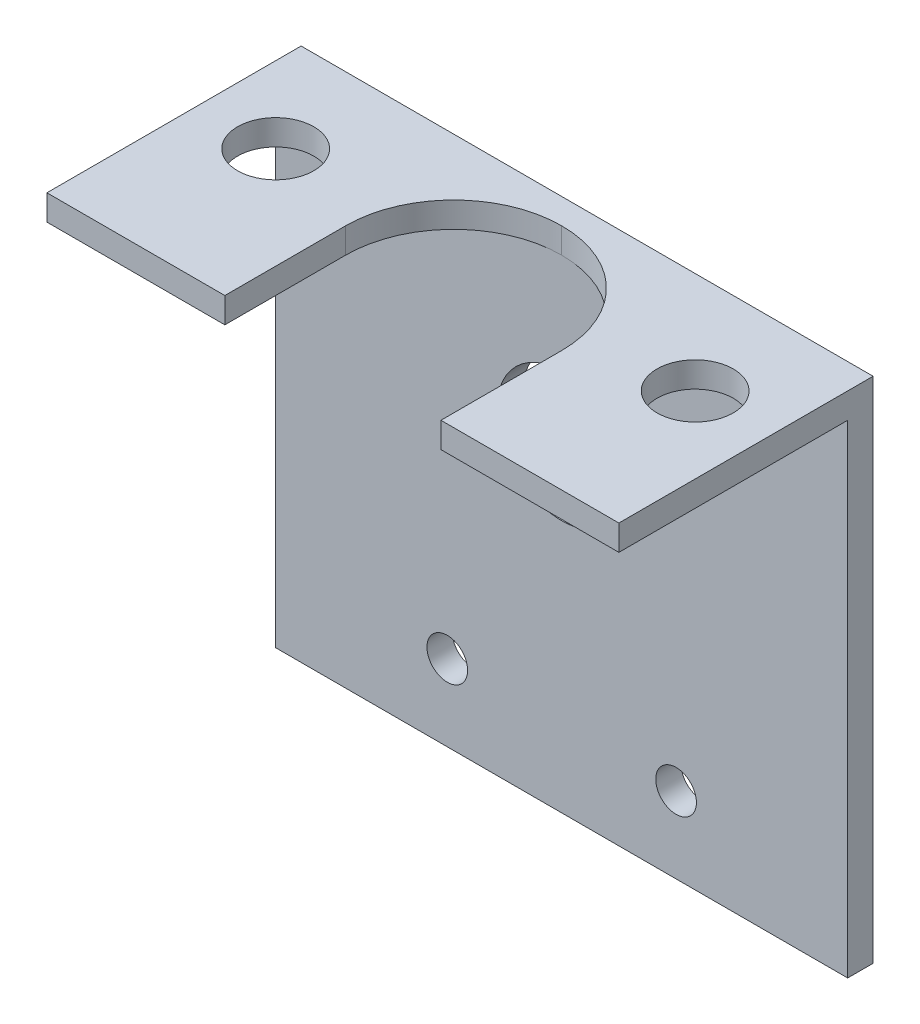
ISO-10303-21;
HEADER;
FILE_DESCRIPTION(('STEP AP214'),'2;1');
FILE_NAME('part.step','',(''),(''),'','','');
FILE_SCHEMA(('AUTOMOTIVE_DESIGN { 1 0 10303 214 1 1 1 1 }'));
ENDSEC;
DATA;
#1=APPLICATION_CONTEXT('core data for automotive mechanical design processes');
#2=APPLICATION_PROTOCOL_DEFINITION('international standard','automotive_design',2000,#1);
#3=PRODUCT_CONTEXT('',#1,'mechanical');
#4=PRODUCT('Part','Part','',(#3));
#5=PRODUCT_RELATED_PRODUCT_CATEGORY('part','',(#4));
#6=PRODUCT_DEFINITION_FORMATION('','',#4);
#7=PRODUCT_DEFINITION_CONTEXT('part definition',#1,'design');
#8=PRODUCT_DEFINITION('design','',#6,#7);
#9=PRODUCT_DEFINITION_SHAPE('','',#8);
#10=(LENGTH_UNIT() NAMED_UNIT(*) SI_UNIT(.MILLI.,.METRE.));
#11=(NAMED_UNIT(*) PLANE_ANGLE_UNIT() SI_UNIT($,.RADIAN.));
#12=(NAMED_UNIT(*) SI_UNIT($,.STERADIAN.) SOLID_ANGLE_UNIT());
#13=UNCERTAINTY_MEASURE_WITH_UNIT(LENGTH_MEASURE(1.E-05),#10,'distance_accuracy_value','');
#14=(GEOMETRIC_REPRESENTATION_CONTEXT(3) GLOBAL_UNCERTAINTY_ASSIGNED_CONTEXT((#13)) GLOBAL_UNIT_ASSIGNED_CONTEXT((#10,
#11,#12)) REPRESENTATION_CONTEXT('',''));
#15=CARTESIAN_POINT('',(0.,0.,0.));
#16=DIRECTION('',(0.,0.,1.));
#17=DIRECTION('',(1.,0.,0.));
#18=AXIS2_PLACEMENT_3D('',#15,#16,#17);
#19=CARTESIAN_POINT('',(45.,40.,18.));
#20=DIRECTION('',(0.,0.,-1.));
#21=DIRECTION('',(-1.,0.,0.));
#22=AXIS2_PLACEMENT_3D('',#19,#20,#21);
#23=PLANE('',#22);
#24=DIRECTION('',(-1.,0.,0.));
#25=VECTOR('',#24,1.);
#26=CARTESIAN_POINT('',(45.,40.,18.));
#27=LINE('',#26,#25);
#28=CARTESIAN_POINT('',(45.,40.,18.));
#29=VERTEX_POINT('',#28);
#30=CARTESIAN_POINT('',(31.,40.,18.));
#31=VERTEX_POINT('',#30);
#32=EDGE_CURVE('E121',#29,#31,#27,.T.);
#33=ORIENTED_EDGE('',*,*,#32,.T.);
#34=DIRECTION('',(0.,-1.,0.));
#35=VECTOR('',#34,1.);
#36=CARTESIAN_POINT('',(31.,40.,18.));
#37=LINE('',#36,#35);
#38=CARTESIAN_POINT('',(31.,38.,18.));
#39=VERTEX_POINT('',#38);
#40=EDGE_CURVE('E131',#31,#39,#37,.T.);
#41=ORIENTED_EDGE('',*,*,#40,.T.);
#42=DIRECTION('',(-1.,0.,0.));
#43=VECTOR('',#42,1.);
#44=CARTESIAN_POINT('',(45.,38.,18.));
#45=LINE('',#44,#43);
#46=CARTESIAN_POINT('',(45.,38.,18.));
#47=VERTEX_POINT('',#46);
#48=EDGE_CURVE('E146',#47,#39,#45,.T.);
#49=ORIENTED_EDGE('',*,*,#48,.F.);
#50=DIRECTION('',(0.,-1.,0.));
#51=VECTOR('',#50,1.);
#52=CARTESIAN_POINT('',(45.,40.,18.));
#53=LINE('',#52,#51);
#54=EDGE_CURVE('E140',#29,#47,#53,.T.);
#55=ORIENTED_EDGE('',*,*,#54,.F.);
#56=EDGE_LOOP('',(#33,#41,#49,#55));
#57=FACE_BOUND('',#56,.T.);
#58=ADVANCED_FACE('F34',(#57),#23,.F.);
#59=CARTESIAN_POINT('',(45.,38.,18.));
#60=DIRECTION('',(0.,1.,0.));
#61=DIRECTION('',(0.,0.,1.));
#62=AXIS2_PLACEMENT_3D('',#59,#60,#61);
#63=PLANE('',#62);
#64=CARTESIAN_POINT('',(39.,38.,6.));
#65=DIRECTION('',(0.,-1.,0.));
#66=DIRECTION('',(0.,0.,-1.));
#67=AXIS2_PLACEMENT_3D('',#64,#65,#66);
#68=CIRCLE('',#67,3.);
#69=CARTESIAN_POINT('',(39.,38.,3.));
#70=VERTEX_POINT('',#69);
#71=EDGE_CURVE('E177',#70,#70,#68,.T.);
#72=ORIENTED_EDGE('',*,*,#71,.F.);
#73=EDGE_LOOP('',(#72));
#74=FACE_BOUND('',#73,.T.);
#75=ORIENTED_EDGE('',*,*,#48,.T.);
#76=DIRECTION('',(0.,0.,1.));
#77=VECTOR('',#76,1.);
#78=CARTESIAN_POINT('',(31.,38.,18.));
#79=LINE('',#78,#77);
#80=CARTESIAN_POINT('',(31.,38.,8.5));
#81=VERTEX_POINT('',#80);
#82=EDGE_CURVE('E134',#81,#39,#79,.T.);
#83=ORIENTED_EDGE('',*,*,#82,.F.);
#84=CARTESIAN_POINT('',(22.5,38.,8.5));
#85=DIRECTION('',(0.,1.,0.));
#86=DIRECTION('',(0.,0.,1.));
#87=AXIS2_PLACEMENT_3D('',#84,#85,#86);
#88=CIRCLE('',#87,8.5);
#89=CARTESIAN_POINT('',(22.5,38.,0.));
#90=VERTEX_POINT('',#89);
#91=EDGE_CURVE('E151',#81,#90,#88,.T.);
#92=ORIENTED_EDGE('',*,*,#91,.T.);
#93=DIRECTION('',(-1.,0.,0.));
#94=VECTOR('',#93,1.);
#95=CARTESIAN_POINT('',(45.,38.,0.));
#96=LINE('',#95,#94);
#97=CARTESIAN_POINT('',(45.,38.,0.));
#98=VERTEX_POINT('',#97);
#99=EDGE_CURVE('E231',#98,#90,#96,.T.);
#100=ORIENTED_EDGE('',*,*,#99,.F.);
#101=DIRECTION('',(0.,0.,-1.));
#102=VECTOR('',#101,1.);
#103=CARTESIAN_POINT('',(45.,38.,18.));
#104=LINE('',#103,#102);
#105=EDGE_CURVE('E203',#47,#98,#104,.T.);
#106=ORIENTED_EDGE('',*,*,#105,.F.);
#107=EDGE_LOOP('',(#75,#83,#92,#100,#106));
#108=FACE_BOUND('',#107,.T.);
#109=ADVANCED_FACE('F171',(#74,#108),#63,.F.);
#110=CARTESIAN_POINT('',(45.,40.,-2.));
#111=DIRECTION('',(0.,-1.,0.));
#112=DIRECTION('',(0.,0.,-1.));
#113=AXIS2_PLACEMENT_3D('',#110,#111,#112);
#114=PLANE('',#113);
#115=CARTESIAN_POINT('',(6.,40.,6.));
#116=DIRECTION('',(0.,-1.,0.));
#117=DIRECTION('',(0.,0.,-1.));
#118=AXIS2_PLACEMENT_3D('',#115,#116,#117);
#119=CIRCLE('',#118,3.);
#120=CARTESIAN_POINT('',(6.,40.,3.));
#121=VERTEX_POINT('',#120);
#122=EDGE_CURVE('E198',#121,#121,#119,.T.);
#123=ORIENTED_EDGE('',*,*,#122,.T.);
#124=EDGE_LOOP('',(#123));
#125=FACE_BOUND('',#124,.T.);
#126=CARTESIAN_POINT('',(39.,40.,6.));
#127=DIRECTION('',(0.,-1.,0.));
#128=DIRECTION('',(0.,0.,-1.));
#129=AXIS2_PLACEMENT_3D('',#126,#127,#128);
#130=CIRCLE('',#129,3.);
#131=CARTESIAN_POINT('',(39.,40.,3.));
#132=VERTEX_POINT('',#131);
#133=EDGE_CURVE('E321',#132,#132,#130,.T.);
#134=ORIENTED_EDGE('',*,*,#133,.T.);
#135=EDGE_LOOP('',(#134));
#136=FACE_BOUND('',#135,.T.);
#137=DIRECTION('',(0.,0.,-1.));
#138=VECTOR('',#137,1.);
#139=CARTESIAN_POINT('',(14.,40.,18.));
#140=LINE('',#139,#138);
#141=CARTESIAN_POINT('',(14.,40.,18.));
#142=VERTEX_POINT('',#141);
#143=CARTESIAN_POINT('',(14.,40.,8.5));
#144=VERTEX_POINT('',#143);
#145=EDGE_CURVE('E127',#142,#144,#140,.T.);
#146=ORIENTED_EDGE('',*,*,#145,.T.);
#147=CARTESIAN_POINT('',(22.5,40.,8.5));
#148=DIRECTION('',(0.,-1.,0.));
#149=DIRECTION('',(0.,0.,-1.));
#150=AXIS2_PLACEMENT_3D('',#147,#148,#149);
#151=CIRCLE('',#150,8.5);
#152=CARTESIAN_POINT('',(22.5,40.,0.));
#153=VERTEX_POINT('',#152);
#154=EDGE_CURVE('E11',#144,#153,#151,.T.);
#155=ORIENTED_EDGE('',*,*,#154,.T.);
#156=CARTESIAN_POINT('',(22.5,40.,8.5));
#157=DIRECTION('',(0.,-1.,0.));
#158=DIRECTION('',(0.,0.,-1.));
#159=AXIS2_PLACEMENT_3D('',#156,#157,#158);
#160=CIRCLE('',#159,8.5);
#161=CARTESIAN_POINT('',(31.,40.,8.5));
#162=VERTEX_POINT('',#161);
#163=EDGE_CURVE('E123',#153,#162,#160,.T.);
#164=ORIENTED_EDGE('',*,*,#163,.T.);
#165=DIRECTION('',(0.,0.,1.));
#166=VECTOR('',#165,1.);
#167=CARTESIAN_POINT('',(31.,40.,18.));
#168=LINE('',#167,#166);
#169=EDGE_CURVE('E116',#162,#31,#168,.T.);
#170=ORIENTED_EDGE('',*,*,#169,.T.);
#171=ORIENTED_EDGE('',*,*,#32,.F.);
#172=DIRECTION('',(0.,0.,1.));
#173=VECTOR('',#172,1.);
#174=CARTESIAN_POINT('',(45.,40.,-2.));
#175=LINE('',#174,#173);
#176=CARTESIAN_POINT('',(45.,40.,-2.));
#177=VERTEX_POINT('',#176);
#178=EDGE_CURVE('E199',#177,#29,#175,.T.);
#179=ORIENTED_EDGE('',*,*,#178,.F.);
#180=DIRECTION('',(-1.,0.,0.));
#181=VECTOR('',#180,1.);
#182=CARTESIAN_POINT('',(45.,40.,-2.));
#183=LINE('',#182,#181);
#184=CARTESIAN_POINT('',(0.,40.,-2.));
#185=VERTEX_POINT('',#184);
#186=EDGE_CURVE('E211',#177,#185,#183,.T.);
#187=ORIENTED_EDGE('',*,*,#186,.T.);
#188=DIRECTION('',(0.,0.,1.));
#189=VECTOR('',#188,1.);
#190=CARTESIAN_POINT('',(0.,40.,-2.));
#191=LINE('',#190,#189);
#192=CARTESIAN_POINT('',(0.,40.,18.));
#193=VERTEX_POINT('',#192);
#194=EDGE_CURVE('E182',#185,#193,#191,.T.);
#195=ORIENTED_EDGE('',*,*,#194,.T.);
#196=EDGE_CURVE('E143',#142,#193,#27,.T.);
#197=ORIENTED_EDGE('',*,*,#196,.F.);
#198=EDGE_LOOP('',(#146,#155,#164,#170,#171,#179,#187,#195,#197));
#199=FACE_BOUND('',#198,.T.);
#200=ADVANCED_FACE('F118',(#125,#136,#199),#114,.F.);
#201=CARTESIAN_POINT('',(14.,38.,18.));
#202=VERTEX_POINT('',#201);
#203=CARTESIAN_POINT('',(0.,38.,18.));
#204=VERTEX_POINT('',#203);
#205=EDGE_CURVE('E232',#202,#204,#45,.T.);
#206=ORIENTED_EDGE('',*,*,#205,.F.);
#207=DIRECTION('',(0.,-1.,0.));
#208=VECTOR('',#207,1.);
#209=CARTESIAN_POINT('',(14.,40.,18.));
#210=LINE('',#209,#208);
#211=EDGE_CURVE('E138',#142,#202,#210,.T.);
#212=ORIENTED_EDGE('',*,*,#211,.F.);
#213=ORIENTED_EDGE('',*,*,#196,.T.);
#214=DIRECTION('',(0.,-1.,0.));
#215=VECTOR('',#214,1.);
#216=CARTESIAN_POINT('',(0.,40.,18.));
#217=LINE('',#216,#215);
#218=EDGE_CURVE('E214',#193,#204,#217,.T.);
#219=ORIENTED_EDGE('',*,*,#218,.T.);
#220=EDGE_LOOP('',(#206,#212,#213,#219));
#221=FACE_BOUND('',#220,.T.);
#222=ADVANCED_FACE('F257',(#221),#23,.F.);
#223=CARTESIAN_POINT('',(6.,38.,6.));
#224=DIRECTION('',(0.,-1.,0.));
#225=DIRECTION('',(0.,0.,-1.));
#226=AXIS2_PLACEMENT_3D('',#223,#224,#225);
#227=CIRCLE('',#226,3.);
#228=CARTESIAN_POINT('',(6.,38.,3.));
#229=VERTEX_POINT('',#228);
#230=EDGE_CURVE('E320',#229,#229,#227,.T.);
#231=ORIENTED_EDGE('',*,*,#230,.F.);
#232=EDGE_LOOP('',(#231));
#233=FACE_BOUND('',#232,.T.);
#234=CARTESIAN_POINT('',(0.,38.,0.));
#235=VERTEX_POINT('',#234);
#236=EDGE_CURVE('E161',#90,#235,#96,.T.);
#237=ORIENTED_EDGE('',*,*,#236,.F.);
#238=CARTESIAN_POINT('',(22.5,38.,8.5));
#239=DIRECTION('',(0.,1.,0.));
#240=DIRECTION('',(0.,0.,1.));
#241=AXIS2_PLACEMENT_3D('',#238,#239,#240);
#242=CIRCLE('',#241,8.5);
#243=CARTESIAN_POINT('',(14.,38.,8.5));
#244=VERTEX_POINT('',#243);
#245=EDGE_CURVE('E43',#90,#244,#242,.T.);
#246=ORIENTED_EDGE('',*,*,#245,.T.);
#247=DIRECTION('',(0.,0.,-1.));
#248=VECTOR('',#247,1.);
#249=CARTESIAN_POINT('',(14.,38.,18.));
#250=LINE('',#249,#248);
#251=EDGE_CURVE('E128',#202,#244,#250,.T.);
#252=ORIENTED_EDGE('',*,*,#251,.F.);
#253=ORIENTED_EDGE('',*,*,#205,.T.);
#254=DIRECTION('',(0.,0.,-1.));
#255=VECTOR('',#254,1.);
#256=CARTESIAN_POINT('',(0.,38.,18.));
#257=LINE('',#256,#255);
#258=EDGE_CURVE('E217',#204,#235,#257,.T.);
#259=ORIENTED_EDGE('',*,*,#258,.T.);
#260=EDGE_LOOP('',(#237,#246,#252,#253,#259));
#261=FACE_BOUND('',#260,.T.);
#262=ADVANCED_FACE('F158',(#233,#261),#63,.F.);
#263=CARTESIAN_POINT('',(45.,38.,0.));
#264=DIRECTION('',(0.,0.,-1.));
#265=DIRECTION('',(-1.,0.,0.));
#266=AXIS2_PLACEMENT_3D('',#263,#264,#265);
#267=PLANE('',#266);
#268=CARTESIAN_POINT('',(22.5,25.,0.));
#269=DIRECTION('',(0.,0.,1.));
#270=DIRECTION('',(1.,0.,0.));
#271=AXIS2_PLACEMENT_3D('',#268,#269,#270);
#272=CIRCLE('',#271,5.1);
#273=CARTESIAN_POINT('',(27.6,25.,0.));
#274=VERTEX_POINT('',#273);
#275=EDGE_CURVE('E183',#274,#274,#272,.T.);
#276=ORIENTED_EDGE('',*,*,#275,.F.);
#277=EDGE_LOOP('',(#276));
#278=FACE_BOUND('',#277,.T.);
#279=CARTESIAN_POINT('',(31.5,6.,0.));
#280=DIRECTION('',(0.,0.,1.));
#281=DIRECTION('',(1.,0.,0.));
#282=AXIS2_PLACEMENT_3D('',#279,#280,#281);
#283=CIRCLE('',#282,1.6);
#284=CARTESIAN_POINT('',(33.1,6.,0.));
#285=VERTEX_POINT('',#284);
#286=EDGE_CURVE('E189',#285,#285,#283,.T.);
#287=ORIENTED_EDGE('',*,*,#286,.F.);
#288=EDGE_LOOP('',(#287));
#289=FACE_BOUND('',#288,.T.);
#290=CARTESIAN_POINT('',(13.5,6.,0.));
#291=DIRECTION('',(0.,0.,1.));
#292=DIRECTION('',(1.,0.,0.));
#293=AXIS2_PLACEMENT_3D('',#290,#291,#292);
#294=CIRCLE('',#293,1.6);
#295=CARTESIAN_POINT('',(15.1,6.,0.));
#296=VERTEX_POINT('',#295);
#297=EDGE_CURVE('E195',#296,#296,#294,.T.);
#298=ORIENTED_EDGE('',*,*,#297,.F.);
#299=EDGE_LOOP('',(#298));
#300=FACE_BOUND('',#299,.T.);
#301=ORIENTED_EDGE('',*,*,#99,.T.);
#302=ORIENTED_EDGE('',*,*,#236,.T.);
#303=DIRECTION('',(0.,-1.,0.));
#304=VECTOR('',#303,1.);
#305=CARTESIAN_POINT('',(0.,38.,0.));
#306=LINE('',#305,#304);
#307=CARTESIAN_POINT('',(0.,0.,0.));
#308=VERTEX_POINT('',#307);
#309=EDGE_CURVE('E219',#235,#308,#306,.T.);
#310=ORIENTED_EDGE('',*,*,#309,.T.);
#311=DIRECTION('',(-1.,0.,0.));
#312=VECTOR('',#311,1.);
#313=CARTESIAN_POINT('',(45.,0.,0.));
#314=LINE('',#313,#312);
#315=CARTESIAN_POINT('',(45.,0.,0.));
#316=VERTEX_POINT('',#315);
#317=EDGE_CURVE('E229',#316,#308,#314,.T.);
#318=ORIENTED_EDGE('',*,*,#317,.F.);
#319=DIRECTION('',(0.,-1.,0.));
#320=VECTOR('',#319,1.);
#321=CARTESIAN_POINT('',(45.,38.,0.));
#322=LINE('',#321,#320);
#323=EDGE_CURVE('E205',#98,#316,#322,.T.);
#324=ORIENTED_EDGE('',*,*,#323,.F.);
#325=EDGE_LOOP('',(#301,#302,#310,#318,#324));
#326=FACE_BOUND('',#325,.T.);
#327=ADVANCED_FACE('F235',(#278,#289,#300,#326),#267,.F.);
#328=CARTESIAN_POINT('',(45.,0.,0.));
#329=DIRECTION('',(0.,1.,0.));
#330=DIRECTION('',(0.,0.,1.));
#331=AXIS2_PLACEMENT_3D('',#328,#329,#330);
#332=PLANE('',#331);
#333=DIRECTION('',(0.,0.,-1.));
#334=VECTOR('',#333,1.);
#335=CARTESIAN_POINT('',(0.,0.,0.));
#336=LINE('',#335,#334);
#337=CARTESIAN_POINT('',(0.,0.,-2.));
#338=VERTEX_POINT('',#337);
#339=EDGE_CURVE('E221',#308,#338,#336,.T.);
#340=ORIENTED_EDGE('',*,*,#339,.T.);
#341=DIRECTION('',(-1.,0.,0.));
#342=VECTOR('',#341,1.);
#343=CARTESIAN_POINT('',(45.,0.,-2.));
#344=LINE('',#343,#342);
#345=CARTESIAN_POINT('',(45.,0.,-2.));
#346=VERTEX_POINT('',#345);
#347=EDGE_CURVE('E226',#346,#338,#344,.T.);
#348=ORIENTED_EDGE('',*,*,#347,.F.);
#349=DIRECTION('',(0.,0.,-1.));
#350=VECTOR('',#349,1.);
#351=CARTESIAN_POINT('',(45.,0.,0.));
#352=LINE('',#351,#350);
#353=EDGE_CURVE('E207',#316,#346,#352,.T.);
#354=ORIENTED_EDGE('',*,*,#353,.F.);
#355=ORIENTED_EDGE('',*,*,#317,.T.);
#356=EDGE_LOOP('',(#340,#348,#354,#355));
#357=FACE_BOUND('',#356,.T.);
#358=ADVANCED_FACE('F247',(#357),#332,.F.);
#359=CARTESIAN_POINT('',(45.,0.,-2.));
#360=DIRECTION('',(0.,0.,1.));
#361=DIRECTION('',(1.,0.,0.));
#362=AXIS2_PLACEMENT_3D('',#359,#360,#361);
#363=PLANE('',#362);
#364=CARTESIAN_POINT('',(22.5,25.,-2.));
#365=DIRECTION('',(0.,0.,1.));
#366=DIRECTION('',(1.,0.,0.));
#367=AXIS2_PLACEMENT_3D('',#364,#365,#366);
#368=CIRCLE('',#367,5.1);
#369=CARTESIAN_POINT('',(27.6,25.,-2.));
#370=VERTEX_POINT('',#369);
#371=EDGE_CURVE('E179',#370,#370,#368,.T.);
#372=ORIENTED_EDGE('',*,*,#371,.T.);
#373=EDGE_LOOP('',(#372));
#374=FACE_BOUND('',#373,.T.);
#375=CARTESIAN_POINT('',(31.5,6.,-2.));
#376=DIRECTION('',(0.,0.,1.));
#377=DIRECTION('',(1.,0.,0.));
#378=AXIS2_PLACEMENT_3D('',#375,#376,#377);
#379=CIRCLE('',#378,1.6);
#380=CARTESIAN_POINT('',(33.1,6.,-2.));
#381=VERTEX_POINT('',#380);
#382=EDGE_CURVE('E186',#381,#381,#379,.T.);
#383=ORIENTED_EDGE('',*,*,#382,.T.);
#384=EDGE_LOOP('',(#383));
#385=FACE_BOUND('',#384,.T.);
#386=CARTESIAN_POINT('',(13.5,6.,-2.));
#387=DIRECTION('',(0.,0.,1.));
#388=DIRECTION('',(1.,0.,0.));
#389=AXIS2_PLACEMENT_3D('',#386,#387,#388);
#390=CIRCLE('',#389,1.6);
#391=CARTESIAN_POINT('',(15.1,6.,-2.));
#392=VERTEX_POINT('',#391);
#393=EDGE_CURVE('E192',#392,#392,#390,.T.);
#394=ORIENTED_EDGE('',*,*,#393,.T.);
#395=EDGE_LOOP('',(#394));
#396=FACE_BOUND('',#395,.T.);
#397=DIRECTION('',(0.,1.,0.));
#398=VECTOR('',#397,1.);
#399=CARTESIAN_POINT('',(0.,0.,-2.));
#400=LINE('',#399,#398);
#401=EDGE_CURVE('E201',#338,#185,#400,.T.);
#402=ORIENTED_EDGE('',*,*,#401,.T.);
#403=ORIENTED_EDGE('',*,*,#186,.F.);
#404=DIRECTION('',(0.,1.,0.));
#405=VECTOR('',#404,1.);
#406=CARTESIAN_POINT('',(45.,0.,-2.));
#407=LINE('',#406,#405);
#408=EDGE_CURVE('E209',#346,#177,#407,.T.);
#409=ORIENTED_EDGE('',*,*,#408,.F.);
#410=ORIENTED_EDGE('',*,*,#347,.T.);
#411=EDGE_LOOP('',(#402,#403,#409,#410));
#412=FACE_BOUND('',#411,.T.);
#413=ADVANCED_FACE('F251',(#374,#385,#396,#412),#363,.F.);
#414=CARTESIAN_POINT('',(45.,0.,0.));
#415=DIRECTION('',(1.,0.,0.));
#416=DIRECTION('',(0.,0.,-1.));
#417=AXIS2_PLACEMENT_3D('',#414,#415,#416);
#418=PLANE('',#417);
#419=ORIENTED_EDGE('',*,*,#178,.T.);
#420=ORIENTED_EDGE('',*,*,#54,.T.);
#421=ORIENTED_EDGE('',*,*,#105,.T.);
#422=ORIENTED_EDGE('',*,*,#323,.T.);
#423=ORIENTED_EDGE('',*,*,#353,.T.);
#424=ORIENTED_EDGE('',*,*,#408,.T.);
#425=EDGE_LOOP('',(#419,#420,#421,#422,#423,#424));
#426=FACE_BOUND('',#425,.T.);
#427=ADVANCED_FACE('F254',(#426),#418,.T.);
#428=CARTESIAN_POINT('',(0.,0.,0.));
#429=DIRECTION('',(1.,0.,0.));
#430=DIRECTION('',(0.,0.,-1.));
#431=AXIS2_PLACEMENT_3D('',#428,#429,#430);
#432=PLANE('',#431);
#433=ORIENTED_EDGE('',*,*,#194,.F.);
#434=ORIENTED_EDGE('',*,*,#401,.F.);
#435=ORIENTED_EDGE('',*,*,#339,.F.);
#436=ORIENTED_EDGE('',*,*,#309,.F.);
#437=ORIENTED_EDGE('',*,*,#258,.F.);
#438=ORIENTED_EDGE('',*,*,#218,.F.);
#439=EDGE_LOOP('',(#433,#434,#435,#436,#437,#438));
#440=FACE_BOUND('',#439,.T.);
#441=ADVANCED_FACE('F243',(#440),#432,.F.);
#442=CARTESIAN_POINT('',(13.5,6.,-2.));
#443=DIRECTION('',(0.,0.,1.));
#444=DIRECTION('',(1.,0.,0.));
#445=AXIS2_PLACEMENT_3D('',#442,#443,#444);
#446=CYLINDRICAL_SURFACE('',#445,1.6);
#447=ORIENTED_EDGE('',*,*,#393,.F.);
#448=EDGE_LOOP('',(#447));
#449=FACE_BOUND('',#448,.T.);
#450=ORIENTED_EDGE('',*,*,#297,.T.);
#451=EDGE_LOOP('',(#450));
#452=FACE_BOUND('',#451,.T.);
#453=ADVANCED_FACE('F287',(#449,#452),#446,.F.);
#454=CARTESIAN_POINT('',(31.5,6.,-2.));
#455=DIRECTION('',(0.,0.,1.));
#456=DIRECTION('',(1.,0.,0.));
#457=AXIS2_PLACEMENT_3D('',#454,#455,#456);
#458=CYLINDRICAL_SURFACE('',#457,1.6);
#459=ORIENTED_EDGE('',*,*,#382,.F.);
#460=EDGE_LOOP('',(#459));
#461=FACE_BOUND('',#460,.T.);
#462=ORIENTED_EDGE('',*,*,#286,.T.);
#463=EDGE_LOOP('',(#462));
#464=FACE_BOUND('',#463,.T.);
#465=ADVANCED_FACE('F292',(#461,#464),#458,.F.);
#466=CARTESIAN_POINT('',(22.5,25.,-2.));
#467=DIRECTION('',(0.,0.,1.));
#468=DIRECTION('',(1.,0.,0.));
#469=AXIS2_PLACEMENT_3D('',#466,#467,#468);
#470=CYLINDRICAL_SURFACE('',#469,5.1);
#471=ORIENTED_EDGE('',*,*,#371,.F.);
#472=EDGE_LOOP('',(#471));
#473=FACE_BOUND('',#472,.T.);
#474=ORIENTED_EDGE('',*,*,#275,.T.);
#475=EDGE_LOOP('',(#474));
#476=FACE_BOUND('',#475,.T.);
#477=ADVANCED_FACE('F296',(#473,#476),#470,.F.);
#478=CARTESIAN_POINT('',(31.,40.,18.));
#479=DIRECTION('',(1.,0.,0.));
#480=DIRECTION('',(0.,0.,-1.));
#481=AXIS2_PLACEMENT_3D('',#478,#479,#480);
#482=PLANE('',#481);
#483=ORIENTED_EDGE('',*,*,#169,.F.);
#484=DIRECTION('',(0.,-1.,0.));
#485=VECTOR('',#484,1.);
#486=CARTESIAN_POINT('',(31.,38.,8.5));
#487=LINE('',#486,#485);
#488=EDGE_CURVE('E142',#162,#81,#487,.T.);
#489=ORIENTED_EDGE('',*,*,#488,.T.);
#490=ORIENTED_EDGE('',*,*,#82,.T.);
#491=ORIENTED_EDGE('',*,*,#40,.F.);
#492=EDGE_LOOP('',(#483,#489,#490,#491));
#493=FACE_BOUND('',#492,.T.);
#494=ADVANCED_FACE('F132',(#493),#482,.F.);
#495=CARTESIAN_POINT('',(14.,40.,18.));
#496=DIRECTION('',(-1.,0.,0.));
#497=DIRECTION('',(0.,0.,1.));
#498=AXIS2_PLACEMENT_3D('',#495,#496,#497);
#499=PLANE('',#498);
#500=ORIENTED_EDGE('',*,*,#251,.T.);
#501=DIRECTION('',(0.,-1.,0.));
#502=VECTOR('',#501,1.);
#503=CARTESIAN_POINT('',(14.,40.,8.5));
#504=LINE('',#503,#502);
#505=EDGE_CURVE('E56',#244,#144,#504,.F.);
#506=ORIENTED_EDGE('',*,*,#505,.T.);
#507=ORIENTED_EDGE('',*,*,#145,.F.);
#508=ORIENTED_EDGE('',*,*,#211,.T.);
#509=EDGE_LOOP('',(#500,#506,#507,#508));
#510=FACE_BOUND('',#509,.T.);
#511=ADVANCED_FACE('F165',(#510),#499,.F.);
#512=CARTESIAN_POINT('',(39.,40.,6.));
#513=DIRECTION('',(0.,-1.,0.));
#514=DIRECTION('',(0.,0.,-1.));
#515=AXIS2_PLACEMENT_3D('',#512,#513,#514);
#516=CYLINDRICAL_SURFACE('',#515,3.);
#517=ORIENTED_EDGE('',*,*,#133,.F.);
#518=EDGE_LOOP('',(#517));
#519=FACE_BOUND('',#518,.T.);
#520=ORIENTED_EDGE('',*,*,#71,.T.);
#521=EDGE_LOOP('',(#520));
#522=FACE_BOUND('',#521,.T.);
#523=ADVANCED_FACE('F305',(#519,#522),#516,.F.);
#524=CARTESIAN_POINT('',(6.,40.,6.));
#525=DIRECTION('',(0.,-1.,0.));
#526=DIRECTION('',(0.,0.,-1.));
#527=AXIS2_PLACEMENT_3D('',#524,#525,#526);
#528=CYLINDRICAL_SURFACE('',#527,3.);
#529=ORIENTED_EDGE('',*,*,#122,.F.);
#530=EDGE_LOOP('',(#529));
#531=FACE_BOUND('',#530,.T.);
#532=ORIENTED_EDGE('',*,*,#230,.T.);
#533=EDGE_LOOP('',(#532));
#534=FACE_BOUND('',#533,.T.);
#535=ADVANCED_FACE('F308',(#531,#534),#528,.F.);
#536=CARTESIAN_POINT('',(22.5,38.,8.5));
#537=DIRECTION('',(0.,1.,0.));
#538=DIRECTION('',(0.,0.,1.));
#539=AXIS2_PLACEMENT_3D('',#536,#537,#538);
#540=CYLINDRICAL_SURFACE('',#539,8.5);
#541=DIRECTION('',(0.,-1.,0.));
#542=VECTOR('',#541,1.);
#543=CARTESIAN_POINT('',(22.5,38.,0.));
#544=LINE('',#543,#542);
#545=EDGE_CURVE('E38',#153,#90,#544,.T.);
#546=ORIENTED_EDGE('',*,*,#545,.F.);
#547=ORIENTED_EDGE('',*,*,#154,.F.);
#548=ORIENTED_EDGE('',*,*,#505,.F.);
#549=ORIENTED_EDGE('',*,*,#245,.F.);
#550=EDGE_LOOP('',(#546,#547,#548,#549));
#551=FACE_BOUND('',#550,.T.);
#552=ADVANCED_FACE('F36',(#551),#540,.F.);
#553=CARTESIAN_POINT('',(22.5,40.,8.5));
#554=DIRECTION('',(0.,1.,0.));
#555=DIRECTION('',(0.,0.,1.));
#556=AXIS2_PLACEMENT_3D('',#553,#554,#555);
#557=CYLINDRICAL_SURFACE('',#556,8.5);
#558=ORIENTED_EDGE('',*,*,#163,.F.);
#559=ORIENTED_EDGE('',*,*,#545,.T.);
#560=ORIENTED_EDGE('',*,*,#91,.F.);
#561=ORIENTED_EDGE('',*,*,#488,.F.);
#562=EDGE_LOOP('',(#558,#559,#560,#561));
#563=FACE_BOUND('',#562,.T.);
#564=ADVANCED_FACE('F169',(#563),#557,.F.);
#565=CLOSED_SHELL('',(#58,#109,#200,#222,#262,#327,#358,#413,#427,#441,#453,#465,#477,#494,#511,
#523,#535,#552,#564));
#566=MANIFOLD_SOLID_BREP('B2',#565);
#567=ADVANCED_BREP_SHAPE_REPRESENTATION('',(#18,#566),#14);
#568=SHAPE_DEFINITION_REPRESENTATION(#9,#567);
ENDSEC;
END-ISO-10303-21;
